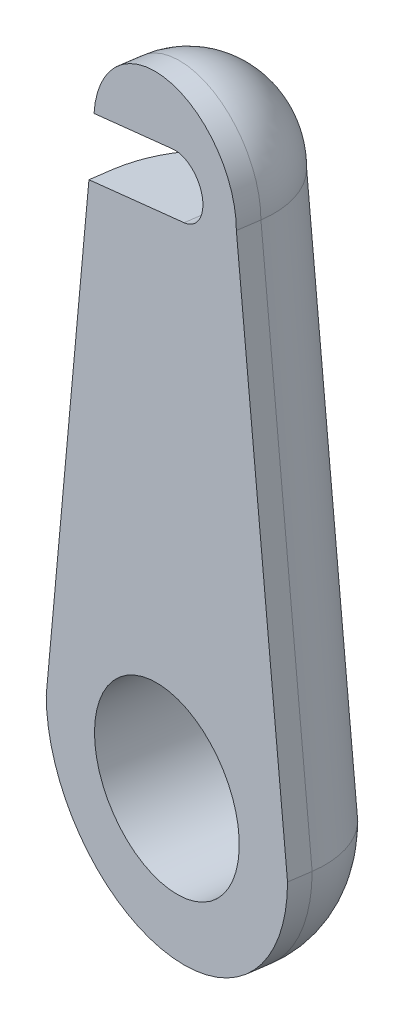
ISO-10303-21;
HEADER;
FILE_DESCRIPTION(('STEP AP214'),'2;1');
FILE_NAME('part.step','',(''),(''),'','','');
FILE_SCHEMA(('AUTOMOTIVE_DESIGN { 1 0 10303 214 1 1 1 1 }'));
ENDSEC;
DATA;
#1=APPLICATION_CONTEXT('core data for automotive mechanical design processes');
#2=APPLICATION_PROTOCOL_DEFINITION('international standard','automotive_design',2000,#1);
#3=PRODUCT_CONTEXT('',#1,'mechanical');
#4=PRODUCT('Part','Part','',(#3));
#5=PRODUCT_RELATED_PRODUCT_CATEGORY('part','',(#4));
#6=PRODUCT_DEFINITION_FORMATION('','',#4);
#7=PRODUCT_DEFINITION_CONTEXT('part definition',#1,'design');
#8=PRODUCT_DEFINITION('design','',#6,#7);
#9=PRODUCT_DEFINITION_SHAPE('','',#8);
#10=(LENGTH_UNIT() NAMED_UNIT(*) SI_UNIT(.MILLI.,.METRE.));
#11=(NAMED_UNIT(*) PLANE_ANGLE_UNIT() SI_UNIT($,.RADIAN.));
#12=(NAMED_UNIT(*) SI_UNIT($,.STERADIAN.) SOLID_ANGLE_UNIT());
#13=UNCERTAINTY_MEASURE_WITH_UNIT(LENGTH_MEASURE(1.E-05),#10,'distance_accuracy_value','');
#14=(GEOMETRIC_REPRESENTATION_CONTEXT(3) GLOBAL_UNCERTAINTY_ASSIGNED_CONTEXT((#13)) GLOBAL_UNIT_ASSIGNED_CONTEXT((#10,
#11,#12)) REPRESENTATION_CONTEXT('',''));
#15=CARTESIAN_POINT('',(0.,0.,0.));
#16=DIRECTION('',(0.,0.,1.));
#17=DIRECTION('',(1.,0.,0.));
#18=AXIS2_PLACEMENT_3D('',#15,#16,#17);
#19=CARTESIAN_POINT('',(1.32790792519997,202.201022667801,-63.0828326373123));
#20=DIRECTION('',(-0.144222021755399,0.,0.98954535441322));
#21=DIRECTION('',(0.98954535441322,0.,0.144222021755399));
#22=AXIS2_PLACEMENT_3D('',#19,#20,#21);
#23=CYLINDRICAL_SURFACE('',#22,8.89);
#24=DIRECTION('',(-0.144222021755399,0.,0.98954535441322));
#25=VECTOR('',#24,1.);
#26=CARTESIAN_POINT('',(-7.46915027553356,202.201022667801,-64.3649664107178));
#27=LINE('',#26,#25);
#28=CARTESIAN_POINT('',(-8.19026038431056,202.201022667801,-59.4172396386517));
#29=VERTEX_POINT('',#28);
#30=CARTESIAN_POINT('',(-8.38496011368034,202.201022667801,-58.0813534101938));
#31=VERTEX_POINT('',#30);
#32=EDGE_CURVE('E152',#29,#31,#27,.T.);
#33=ORIENTED_EDGE('',*,*,#32,.F.);
#34=CARTESIAN_POINT('',(0.606797816422972,202.201022667801,-58.1351058652462));
#35=DIRECTION('',(0.144222021755399,0.,-0.98954535441322));
#36=DIRECTION('',(-0.98954535441322,0.,-0.144222021755399));
#37=AXIS2_PLACEMENT_3D('',#34,#35,#36);
#38=CIRCLE('',#37,8.89);
#39=CARTESIAN_POINT('',(9.4038560171565,202.201022667801,-56.8529720918407));
#40=VERTEX_POINT('',#39);
#41=EDGE_CURVE('E150',#29,#40,#38,.F.);
#42=ORIENTED_EDGE('',*,*,#41,.T.);
#43=DIRECTION('',(-0.144222021755399,0.,0.98954535441322));
#44=VECTOR('',#43,1.);
#45=CARTESIAN_POINT('',(10.1249661259335,202.201022667801,-61.8006988639068));
#46=LINE('',#45,#44);
#47=CARTESIAN_POINT('',(9.20915628778671,202.201022667801,-55.5170858633828));
#48=VERTEX_POINT('',#47);
#49=EDGE_CURVE('E255',#40,#48,#46,.T.);
#50=ORIENTED_EDGE('',*,*,#49,.T.);
#51=CARTESIAN_POINT('',(0.412098087053183,202.201022667801,-56.7992196367883));
#52=DIRECTION('',(0.144222021755399,0.,-0.98954535441322));
#53=DIRECTION('',(-0.98954535441322,0.,-0.144222021755399));
#54=AXIS2_PLACEMENT_3D('',#51,#52,#53);
#55=CIRCLE('',#54,8.89);
#56=EDGE_CURVE('E240',#48,#31,#55,.T.);
#57=ORIENTED_EDGE('',*,*,#56,.T.);
#58=EDGE_LOOP('',(#33,#42,#50,#57));
#59=FACE_BOUND('',#58,.T.);
#60=ADVANCED_FACE('F39',(#59),#23,.T.);
#61=CARTESIAN_POINT('',(-3.99727184027272,235.201022667801,-63.85895491262));
#62=DIRECTION('',(0.983999449071481,-0.105724104961713,0.143413729667237));
#63=DIRECTION('',(0.144222021755399,0.,-0.98954535441322));
#64=AXIS2_PLACEMENT_3D('',#61,#62,#63);
#65=PLANE('',#64);
#66=DIRECTION('',(0.104618796914359,0.994395501613943,0.0152477441658583));
#67=VECTOR('',#66,1.);
#68=CARTESIAN_POINT('',(-4.9130816784195,235.201022667801,-57.5753419120961));
#69=LINE('',#68,#67);
#70=CARTESIAN_POINT('',(-5.27238963990794,231.785821660561,-57.6277095174894));
#71=VERTEX_POINT('',#70);
#72=EDGE_CURVE('E289',#31,#71,#69,.T.);
#73=ORIENTED_EDGE('',*,*,#72,.T.);
#74=DIRECTION('',(0.144222021755399,0.,-0.98954535441322));
#75=VECTOR('',#74,1.);
#76=CARTESIAN_POINT('',(-4.35657980176115,231.785821660561,-63.9113225180133));
#77=LINE('',#76,#75);
#78=CARTESIAN_POINT('',(-5.07768991053815,231.785821660561,-58.9635957459472));
#79=VERTEX_POINT('',#78);
#80=EDGE_CURVE('E172',#71,#79,#77,.T.);
#81=ORIENTED_EDGE('',*,*,#80,.T.);
#82=DIRECTION('',(0.104618796914359,0.994395501613943,0.0152477441658583));
#83=VECTOR('',#82,1.);
#84=CARTESIAN_POINT('',(-8.19026038431056,202.201022667801,-59.4172396386517));
#85=LINE('',#84,#83);
#86=EDGE_CURVE('E157',#79,#29,#85,.F.);
#87=ORIENTED_EDGE('',*,*,#86,.T.);
#88=ORIENTED_EDGE('',*,*,#32,.T.);
#89=EDGE_LOOP('',(#73,#81,#87,#88));
#90=FACE_BOUND('',#89,.T.);
#91=ADVANCED_FACE('F227',(#90),#65,.F.);
#92=CARTESIAN_POINT('',(1.19784127039669,235.201022667801,-63.1017892984042));
#93=DIRECTION('',(-0.144222021755399,0.,0.98954535441322));
#94=DIRECTION('',(0.98954535441322,0.,0.144222021755399));
#95=AXIS2_PLACEMENT_3D('',#92,#93,#94);
#96=CYLINDRICAL_SURFACE('',#95,5.25);
#97=CARTESIAN_POINT('',(0.476731161619694,235.201022667801,-58.1540625263381));
#98=DIRECTION('',(0.144222021755399,0.,-0.98954535441322));
#99=DIRECTION('',(-0.98954535441322,0.,-0.144222021755399));
#100=AXIS2_PLACEMENT_3D('',#97,#98,#99);
#101=CIRCLE('',#100,5.25);
#102=CARTESIAN_POINT('',(5.6718442722891,235.201022667801,-57.3968969121223));
#103=VERTEX_POINT('',#102);
#104=CARTESIAN_POINT('',(-4.70527140568887,235.573768649503,-58.909317334686));
#105=VERTEX_POINT('',#104);
#106=EDGE_CURVE('E147',#103,#105,#101,.F.);
#107=ORIENTED_EDGE('',*,*,#106,.T.);
#108=DIRECTION('',(-0.144222021755399,0.,0.98954535441322));
#109=VECTOR('',#108,1.);
#110=CARTESIAN_POINT('',(-3.98416129691187,235.573768649503,-63.8570441067521));
#111=LINE('',#110,#109);
#112=CARTESIAN_POINT('',(-4.89997113505866,235.573768649503,-57.5734311062281));
#113=VERTEX_POINT('',#112);
#114=EDGE_CURVE('E68',#105,#113,#111,.T.);
#115=ORIENTED_EDGE('',*,*,#114,.T.);
#116=CARTESIAN_POINT('',(0.282031432249903,235.201022667801,-56.8181762978803));
#117=DIRECTION('',(0.144222021755399,0.,-0.98954535441322));
#118=DIRECTION('',(-0.98954535441322,0.,-0.144222021755399));
#119=AXIS2_PLACEMENT_3D('',#116,#117,#118);
#120=CIRCLE('',#119,5.25);
#121=CARTESIAN_POINT('',(5.47714454291931,235.201022667801,-56.0610106836644));
#122=VERTEX_POINT('',#121);
#123=EDGE_CURVE('E258',#113,#122,#120,.T.);
#124=ORIENTED_EDGE('',*,*,#123,.T.);
#125=DIRECTION('',(-0.144222021755399,0.,0.98954535441322));
#126=VECTOR('',#125,1.);
#127=CARTESIAN_POINT('',(6.39295438106609,235.201022667801,-62.3446236841884));
#128=LINE('',#127,#126);
#129=EDGE_CURVE('E243',#103,#122,#128,.T.);
#130=ORIENTED_EDGE('',*,*,#129,.F.);
#131=EDGE_LOOP('',(#107,#115,#124,#130));
#132=FACE_BOUND('',#131,.T.);
#133=ADVANCED_FACE('F223',(#132),#96,.T.);
#134=CARTESIAN_POINT('',(10.1249661259335,202.201022667801,-61.8006988639068));
#135=DIRECTION('',(-0.983145599511407,-0.113546955234429,-0.143289284729692));
#136=DIRECTION('',(-0.144222021755399,0.,0.98954535441322));
#137=AXIS2_PLACEMENT_3D('',#134,#135,#136);
#138=PLANE('',#137);
#139=ORIENTED_EDGE('',*,*,#49,.F.);
#140=DIRECTION('',(0.112359862059995,-0.993532631047914,0.0163759714480791));
#141=VECTOR('',#140,1.);
#142=CARTESIAN_POINT('',(5.6718442722891,235.201022667801,-57.3968969121223));
#143=LINE('',#142,#141);
#144=EDGE_CURVE('E160',#40,#103,#143,.F.);
#145=ORIENTED_EDGE('',*,*,#144,.T.);
#146=ORIENTED_EDGE('',*,*,#129,.T.);
#147=DIRECTION('',(0.112359862059995,-0.993532631047914,0.016375971448079));
#148=VECTOR('',#147,1.);
#149=CARTESIAN_POINT('',(9.20915628778671,202.201022667801,-55.5170858633828));
#150=LINE('',#149,#148);
#151=EDGE_CURVE('E292',#122,#48,#150,.T.);
#152=ORIENTED_EDGE('',*,*,#151,.T.);
#153=EDGE_LOOP('',(#139,#145,#146,#152));
#154=FACE_BOUND('',#153,.T.);
#155=ADVANCED_FACE('F217',(#154),#138,.F.);
#156=CARTESIAN_POINT('',(1.32790792519997,202.201022667801,-63.0828326373123));
#157=DIRECTION('',(0.144222021755399,0.,-0.98954535441322));
#158=DIRECTION('',(-0.98954535441322,0.,-0.144222021755399));
#159=AXIS2_PLACEMENT_3D('',#156,#157,#158);
#160=PLANE('',#159);
#161=CARTESIAN_POINT('',(1.32790792519973,202.201022667801,-63.0828326373124));
#162=DIRECTION('',(0.144222021755399,0.,-0.98954535441322));
#163=DIRECTION('',(-0.98954535441322,0.,-0.144222021755399));
#164=AXIS2_PLACEMENT_3D('',#161,#162,#163);
#165=CIRCLE('',#164,5.334);
#166=CARTESIAN_POINT('',(-2.06352718910728,206.288247154302,-63.5771198639222));
#167=VERTEX_POINT('',#166);
#168=CARTESIAN_POINT('',(4.67897303171075,206.322112414766,-62.5944291674364));
#169=VERTEX_POINT('',#168);
#170=EDGE_CURVE('E60',#167,#169,#165,.T.);
#171=ORIENTED_EDGE('',*,*,#170,.F.);
#172=DIRECTION('',(0.104618796914359,0.994395501613943,0.0152477441658583));
#173=VECTOR('',#172,1.);
#174=CARTESIAN_POINT('',(0.922725405084686,234.672402142993,-63.1418862642839));
#175=LINE('',#174,#173);
#176=CARTESIAN_POINT('',(0.747199470832463,233.004038478097,-63.1674684217822));
#177=VERTEX_POINT('',#176);
#178=EDGE_CURVE('E137',#167,#177,#175,.T.);
#179=ORIENTED_EDGE('',*,*,#178,.T.);
#180=DIRECTION('',(-0.963046923912847,-0.229868866995661,-0.140359988344739));
#181=VECTOR('',#180,1.);
#182=CARTESIAN_POINT('',(-5.12264944920181,231.602969135389,-64.0229739070746));
#183=LINE('',#182,#181);
#184=CARTESIAN_POINT('',(1.63744916341812,233.216531434667,-63.0377183199206));
#185=VERTEX_POINT('',#184);
#186=EDGE_CURVE('E131',#185,#177,#183,.T.);
#187=ORIENTED_EDGE('',*,*,#186,.F.);
#188=DIRECTION('',(0.112359862059995,-0.993532631047914,0.0163759714480791));
#189=VECTOR('',#188,1.);
#190=CARTESIAN_POINT('',(5.20923812837646,201.633287891629,-62.5171452875552));
#191=LINE('',#190,#189);
#192=EDGE_CURVE('E140',#185,#169,#191,.T.);
#193=ORIENTED_EDGE('',*,*,#192,.T.);
#194=EDGE_LOOP('',(#171,#179,#187,#193));
#195=FACE_BOUND('',#194,.T.);
#196=ADVANCED_FACE('F135',(#195),#160,.T.);
#197=CARTESIAN_POINT('',(0.412098087053183,202.201022667801,-56.7992196367883));
#198=DIRECTION('',(0.144222021755399,0.,-0.98954535441322));
#199=DIRECTION('',(-0.98954535441322,0.,-0.144222021755399));
#200=AXIS2_PLACEMENT_3D('',#197,#198,#199);
#201=PLANE('',#200);
#202=CARTESIAN_POINT('',(0.412098087052936,202.201022667801,-56.7992196367884));
#203=DIRECTION('',(0.144222021755399,0.,-0.98954535441322));
#204=DIRECTION('',(-0.98954535441322,0.,-0.144222021755399));
#205=AXIS2_PLACEMENT_3D('',#202,#203,#204);
#206=CIRCLE('',#205,5.334);
#207=CARTESIAN_POINT('',(-4.86613683338719,202.201022667801,-57.5684999008317));
#208=VERTEX_POINT('',#207);
#209=EDGE_CURVE('E141',#208,#208,#206,.F.);
#210=ORIENTED_EDGE('',*,*,#209,.F.);
#211=EDGE_LOOP('',(#210));
#212=FACE_BOUND('',#211,.T.);
#213=CARTESIAN_POINT('',(1.25647789892657,235.193718971032,-56.6761548747189));
#214=DIRECTION('',(0.144222021755399,0.,-0.98954535441322));
#215=DIRECTION('',(-0.98954535441322,0.,-0.144222021755399));
#216=AXIS2_PLACEMENT_3D('',#213,#214,#215);
#217=CIRCLE('',#216,1.79999999999998);
#218=CARTESIAN_POINT('',(1.66591610395417,233.441920071354,-56.6164809997927));
#219=VERTEX_POINT('',#218);
#220=CARTESIAN_POINT('',(0.847039693898966,236.945517870711,-56.735828749645));
#221=VERTEX_POINT('',#220);
#222=EDGE_CURVE('E268',#219,#221,#217,.F.);
#223=ORIENTED_EDGE('',*,*,#222,.F.);
#224=DIRECTION('',(0.963046923912847,0.229868866995661,0.140359988344738));
#225=VECTOR('',#224,1.);
#226=CARTESIAN_POINT('',(-6.0384592873486,231.602969135389,-57.7393609065506));
#227=LINE('',#226,#225);
#228=EDGE_CURVE('E277',#71,#219,#227,.T.);
#229=ORIENTED_EDGE('',*,*,#228,.F.);
#230=ORIENTED_EDGE('',*,*,#72,.F.);
#231=ORIENTED_EDGE('',*,*,#56,.F.);
#232=ORIENTED_EDGE('',*,*,#151,.F.);
#233=ORIENTED_EDGE('',*,*,#123,.F.);
#234=DIRECTION('',(-0.963046923912849,-0.229868866995653,-0.140359988344738));
#235=VECTOR('',#234,1.);
#236=CARTESIAN_POINT('',(-6.85733569740383,235.106566934746,-57.8587086564029));
#237=LINE('',#236,#235);
#238=EDGE_CURVE('E275',#221,#113,#237,.T.);
#239=ORIENTED_EDGE('',*,*,#238,.F.);
#240=EDGE_LOOP('',(#223,#229,#230,#231,#232,#233,#239));
#241=FACE_BOUND('',#240,.T.);
#242=ADVANCED_FACE('F216',(#212,#241),#201,.F.);
#243=CARTESIAN_POINT('',(0.606797816422972,202.201022667801,-58.1351058652462));
#244=DIRECTION('',(0.144222021755399,0.,-0.98954535441322));
#245=DIRECTION('',(-0.98954535441322,0.,-0.144222021755399));
#246=AXIS2_PLACEMENT_3D('',#243,#244,#245);
#247=DEGENERATE_TOROIDAL_SURFACE('',#246,3.89,5.,.T.);
#248=CARTESIAN_POINT('',(1.29718102724183,202.201022667801,-62.8720072809629));
#249=DIRECTION('',(-0.144222021755399,0.,0.98954535441322));
#250=DIRECTION('',(0.98954535441322,0.,0.144222021755399));
#251=AXIS2_PLACEMENT_3D('',#248,#249,#250);
#252=CIRCLE('',#251,5.334);
#253=CARTESIAN_POINT('',(6.57251324391213,202.024148140251,-62.103150073634));
#254=VERTEX_POINT('',#253);
#255=CARTESIAN_POINT('',(-3.97853987187495,202.036412593816,-63.6409211371035));
#256=VERTEX_POINT('',#255);
#257=EDGE_CURVE('E127',#254,#256,#252,.F.);
#258=ORIENTED_EDGE('',*,*,#257,.F.);
#259=CARTESIAN_POINT('',(9.4038560171565,202.201022667801,-56.8529720918407));
#260=CARTESIAN_POINT('',(9.42412630268715,202.201024256078,-56.9919468087061));
#261=CARTESIAN_POINT('',(9.43851131748884,202.200685685068,-57.1317770213015));
#262=CARTESIAN_POINT('',(9.45547473273812,202.199339671023,-57.4121418751071));
#263=CARTESIAN_POINT('',(9.45805372614049,202.198332261583,-57.5526764805844));
#264=CARTESIAN_POINT('',(9.45137349914973,202.195660986856,-57.8333556116267));
#265=CARTESIAN_POINT('',(9.44212288736625,202.193997599544,-57.9735003465596));
#266=CARTESIAN_POINT('',(9.41186984101946,202.190036855361,-58.2525047068316));
#267=CARTESIAN_POINT('',(9.3908675444643,202.187739505934,-58.3913643472429));
#268=CARTESIAN_POINT('',(9.33725273725906,202.182540509831,-58.6668535079616));
#269=CARTESIAN_POINT('',(9.30463691425346,202.179638690849,-58.8034823803804));
#270=CARTESIAN_POINT('',(9.2280155962891,202.173268977993,-59.0735490941437));
#271=CARTESIAN_POINT('',(9.1840059112784,202.169800876044,-59.2069857417968));
#272=CARTESIAN_POINT('',(9.08494592308634,202.162348667695,-59.4695924130764));
#273=CARTESIAN_POINT('',(9.02990203638968,202.158364861656,-59.5987648657603));
#274=CARTESIAN_POINT('',(8.90912932363069,202.149933109739,-59.8520536001049));
#275=CARTESIAN_POINT('',(8.8433967871256,202.145485002876,-59.9761681071792));
#276=CARTESIAN_POINT('',(8.70170414407345,202.136186618706,-60.2184574512163));
#277=CARTESIAN_POINT('',(8.62574046156449,202.131336201014,-60.336630191507));
#278=CARTESIAN_POINT('',(8.46414443178475,202.121304196189,-60.5661540416459));
#279=CARTESIAN_POINT('',(8.3785120691605,202.116122608531,-60.6775051406611));
#280=CARTESIAN_POINT('',(8.19814501497439,202.105502140936,-60.8926513535883));
#281=CARTESIAN_POINT('',(8.10340599182041,202.10006313919,-60.9964428300897));
#282=CARTESIAN_POINT('',(7.90556838211683,202.0890149549,-61.1956453082782));
#283=CARTESIAN_POINT('',(7.80247268608047,202.083405831616,-61.2910591841292));
#284=CARTESIAN_POINT('',(7.58840658944286,202.072092874009,-61.4730624763079));
#285=CARTESIAN_POINT('',(7.47742054567895,202.066388869742,-61.5596334840118));
#286=CARTESIAN_POINT('',(7.24859307450871,202.054994522297,-61.7230903448754));
#287=CARTESIAN_POINT('',(7.13075414074614,202.049304174925,-61.7999796891798));
#288=CARTESIAN_POINT('',(6.88906966434531,202.038037749443,-61.9435428406534));
#289=CARTESIAN_POINT('',(6.76522667165525,202.032461624228,-62.0102209354013));
#290=CARTESIAN_POINT('',(6.51241076349984,202.021528780286,-62.1329170147282));
#291=CARTESIAN_POINT('',(6.38343931229342,202.016171999806,-62.1889380160328));
#292=CARTESIAN_POINT('',(6.08328599078852,202.004283379283,-62.3045790530669));
#293=CARTESIAN_POINT('',(5.91068506049706,201.997859821499,-62.3605532278855));
#294=CARTESIAN_POINT('',(5.56065983508997,201.985818914885,-62.4534609887416));
#295=CARTESIAN_POINT('',(5.38324407097413,201.980200238384,-62.4904261976493));
#296=CARTESIAN_POINT('',(5.19321504725838,201.974798125286,-62.5194416140154));
#297=CARTESIAN_POINT('',(5.1819540411644,201.974480279118,-62.5211219029397));
#298=CARTESIAN_POINT('',(5.17068795082224,201.974164594667,-62.5227638117806));
#299=B_SPLINE_CURVE_WITH_KNOTS('',3,(#259,#260,#261,#262,#263,#264,#265,#266,#267,#268,#269,
#270,#271,#272,#273,#274,#275,#276,#277,#278,#279,#280,#281,#282,#283,#284,#285,#286,#287,#288,
#289,#290,#291,#292,#293,#294,#295,#296,#297,#298),.UNSPECIFIED.,.F.,.F.,(4,2,2,2,2,2,2,2,2,2,2,
2,2,2,2,2,2,2,2,4),(0.,0.421206831369678,0.842392507488085,1.26327185380627,1.68414625755094,
2.1051407973978,2.52629037693698,2.94719576105399,3.36824757082313,3.78944692922255,
4.21064695647886,4.63204832876588,5.05330455829163,5.47542059181213,5.89738397447501,
6.3191696912057,6.7408358339336,7.2844667573262,7.82719035935125,7.86136039280626),.UNSPECIFIED.);
#300=EDGE_CURVE('E171',#40,#254,#299,.T.);
#301=ORIENTED_EDGE('',*,*,#300,.F.);
#302=ORIENTED_EDGE('',*,*,#41,.F.);
#303=CARTESIAN_POINT('',(-8.19026038431056,202.201022667801,-59.4172396386517));
#304=CARTESIAN_POINT('',(-8.17001660776571,202.20102414597,-59.5562425641094));
#305=CARTESIAN_POINT('',(-8.14388620286478,202.200708929707,-59.6943852891455));
#306=CARTESIAN_POINT('',(-8.0801048390943,202.19945576104,-59.9679752872192));
#307=CARTESIAN_POINT('',(-8.04245445524943,202.198517839716,-60.1034226944353));
#308=CARTESIAN_POINT('',(-7.95591503164534,202.196030810224,-60.3705645570106));
#309=CARTESIAN_POINT('',(-7.90703412949349,202.19448214402,-60.5022616525508));
#310=CARTESIAN_POINT('',(-7.79837201315606,202.190794553344,-60.7610688771204));
#311=CARTESIAN_POINT('',(-7.73859092761879,202.188655635838,-60.8881790602651));
#312=CARTESIAN_POINT('',(-7.6085337601283,202.183815156139,-61.1369471560684));
#313=CARTESIAN_POINT('',(-7.53825466917452,202.181113432544,-61.2586034924727));
#314=CARTESIAN_POINT('',(-7.38768721602802,202.175182921508,-61.4956053212382));
#315=CARTESIAN_POINT('',(-7.30739517718664,202.171953940329,-61.6109484729632));
#316=CARTESIAN_POINT('',(-7.13744357592207,202.165015530841,-61.8343920819168));
#317=CARTESIAN_POINT('',(-7.04778948519682,202.161306382869,-61.9424967097659));
#318=CARTESIAN_POINT('',(-6.85968004957816,202.153455922581,-62.1508077161011));
#319=CARTESIAN_POINT('',(-6.76122165415579,202.149314460392,-62.2510113342276));
#320=CARTESIAN_POINT('',(-6.55620211186518,202.140657399289,-62.4427961980552));
#321=CARTESIAN_POINT('',(-6.44963874469385,202.136141697824,-62.5343750655732));
#322=CARTESIAN_POINT('',(-6.22919035283221,202.126801991447,-62.7082325665623));
#323=CARTESIAN_POINT('',(-6.11530531794574,202.121977986107,-62.7905111870813));
#324=CARTESIAN_POINT('',(-5.88096608204634,202.112090453154,-62.945225410852));
#325=CARTESIAN_POINT('',(-5.76050875587446,202.107026811748,-63.0176562732658));
#326=CARTESIAN_POINT('',(-5.51397288404291,202.096741139091,-63.1520957167182));
#327=CARTESIAN_POINT('',(-5.38789629089693,202.091519163055,-63.214107882742));
#328=CARTESIAN_POINT('',(-5.1307385626108,202.080988129643,-63.3274109665633));
#329=CARTESIAN_POINT('',(-4.99964860459529,202.0756789291,-63.3786818475399));
#330=CARTESIAN_POINT('',(-4.73366438231908,202.06507336272,-63.469982569554));
#331=CARTESIAN_POINT('',(-4.5987715128207,202.059776992932,-63.5100164743501));
#332=CARTESIAN_POINT('',(-4.32614793975179,202.049290808276,-63.5785759745851));
#333=CARTESIAN_POINT('',(-4.18841847768371,202.044100948696,-63.6071064967909));
#334=CARTESIAN_POINT('',(-3.91108867952755,202.03392565402,-63.652482716766));
#335=CARTESIAN_POINT('',(-3.77148888769873,202.028940161098,-63.6693317416333));
#336=CARTESIAN_POINT('',(-3.45132075089665,202.017893493652,-63.6943769849195));
#337=CARTESIAN_POINT('',(-3.27043892312382,202.011931773933,-63.6987274665849));
#338=CARTESIAN_POINT('',(-2.9094860490671,202.000754457304,-63.6879029349285));
#339=CARTESIAN_POINT('',(-2.7294141545686,201.99553763564,-63.6727603922478));
#340=CARTESIAN_POINT('',(-2.53910521984101,201.990508218119,-63.6463914536853));
#341=CARTESIAN_POINT('',(-2.52742428990585,201.990201479088,-63.6447309723335));
#342=CARTESIAN_POINT('',(-2.51574990281989,201.989896900747,-63.6430293988055));
#343=B_SPLINE_CURVE_WITH_KNOTS('',3,(#303,#304,#305,#306,#307,#308,#309,#310,#311,#312,#313,
#314,#315,#316,#317,#318,#319,#320,#321,#322,#323,#324,#325,#326,#327,#328,#329,#330,#331,#332,
#333,#334,#335,#336,#337,#338,#339,#340,#341,#342),.UNSPECIFIED.,.F.,.F.,(4,2,2,2,2,2,2,2,2,2,2,
2,2,2,2,2,2,2,2,4),(0.,0.421279105882247,0.842537186867095,1.26349098257098,1.68443981033215,
2.10550952528328,2.52673431036025,2.94771427197359,3.36884066476029,3.7900828407431,
4.21132560335999,4.6327704450172,5.0540699727599,5.47614853048732,5.89807424978274,
6.31981907068573,6.74144372177308,7.2834881738521,7.82463087889462,7.86003758452581),.UNSPECIFIED.);
#344=EDGE_CURVE('E197',#256,#29,#343,.F.);
#345=ORIENTED_EDGE('',*,*,#344,.F.);
#346=EDGE_LOOP('',(#258,#301,#302,#345));
#347=FACE_BOUND('',#346,.T.);
#348=ADVANCED_FACE('F41',(#347),#247,.T.);
#349=CARTESIAN_POINT('',(-3.17193326111293,202.607021839285,-58.6858398293254));
#350=DIRECTION('',(-0.104618796914359,-0.994395501613943,-0.0152477441658583));
#351=DIRECTION('',(0.994511117120026,-0.104630960641097,0.));
#352=AXIS2_PLACEMENT_3D('',#349,#350,#351);
#353=CYLINDRICAL_SURFACE('',#352,5.);
#354=CARTESIAN_POINT('',(-3.94766854956164,201.629570040267,-63.6574915342594));
#355=CARTESIAN_POINT('',(-3.96432188749141,201.773665005614,-63.6510133255928));
#356=CARTESIAN_POINT('',(-3.97493342858699,201.918493385998,-63.6450965918439));
#357=CARTESIAN_POINT('',(-3.98398351654456,202.208580424699,-63.6347961659688));
#358=CARTESIAN_POINT('',(-3.98242227019912,202.353839075665,-63.6304124478009));
#359=CARTESIAN_POINT('',(-3.96707006707929,202.643149912608,-63.6236021421536));
#360=CARTESIAN_POINT('',(-3.95333019294466,202.78720460363,-63.6211674606315));
#361=CARTESIAN_POINT('',(-3.91379189958018,203.073659960349,-63.6182603342992));
#362=CARTESIAN_POINT('',(-3.88799411292683,203.216060712412,-63.6177877865653));
#363=CARTESIAN_POINT('',(-3.82455940452392,203.498288878837,-63.6185603652297));
#364=CARTESIAN_POINT('',(-3.78691481597625,203.638114564509,-63.6198066057339));
#365=CARTESIAN_POINT('',(-3.70014267150966,203.914206428317,-63.623489823045));
#366=CARTESIAN_POINT('',(-3.65100974297863,204.050470907778,-63.6259273575532));
#367=CARTESIAN_POINT('',(-3.54170547848049,204.318578359655,-63.631224635489));
#368=CARTESIAN_POINT('',(-3.48152764533985,204.450418675275,-63.6340846272332));
#369=CARTESIAN_POINT('',(-3.35068605936689,204.708801318391,-63.639257596278));
#370=CARTESIAN_POINT('',(-3.28002198647397,204.835343484027,-63.6415705568766));
#371=CARTESIAN_POINT('',(-3.12780131015476,205.084005146356,-63.644547613267));
#372=CARTESIAN_POINT('',(-3.04611428313563,205.206045111585,-63.645189738828));
#373=CARTESIAN_POINT('',(-2.87325332647058,205.44316541499,-63.6434729862167));
#374=CARTESIAN_POINT('',(-2.78208077487341,205.558246760279,-63.6411145434069));
#375=CARTESIAN_POINT('',(-2.59089998096309,205.780802387175,-63.6320147433315));
#376=CARTESIAN_POINT('',(-2.49088549018956,205.88827119094,-63.6252702647813));
#377=CARTESIAN_POINT('',(-2.2829207598651,206.094792728882,-63.6059415588295));
#378=CARTESIAN_POINT('',(-2.17496545260516,206.193840000111,-63.5933535744976));
#379=CARTESIAN_POINT('',(-2.06352718910727,206.288247154302,-63.5771198639222));
#380=B_SPLINE_CURVE_WITH_KNOTS('',3,(#354,#355,#356,#357,#358,#359,#360,#361,#362,#363,#364,
#365,#366,#367,#368,#369,#370,#371,#372,#373,#374,#375,#376,#377,#378,#379),.UNSPECIFIED.,.F.,
.F.,(4,2,2,2,2,2,2,2,2,2,2,2,4),(0.,0.435484494508397,0.870961590977159,1.3046206991464,
1.73825705945014,2.17217463177012,2.60629553634203,3.04067263614974,3.47506299672608,
3.91513705434337,4.35514726742529,4.7954709531655,5.23607812650246),.UNSPECIFIED.);
#381=EDGE_CURVE('E123',#256,#167,#380,.T.);
#382=ORIENTED_EDGE('',*,*,#381,.F.);
#383=ORIENTED_EDGE('',*,*,#344,.T.);
#384=ORIENTED_EDGE('',*,*,#86,.F.);
#385=CARTESIAN_POINT('',(0.0260893620554628,233.004038478097,-58.2197416497161));
#386=DIRECTION('',(0.227465669459786,-0.973221610932542,0.0331521527367372));
#387=DIRECTION('',(-0.963046923912847,-0.229868866995661,-0.140359988344738));
#388=AXIS2_PLACEMENT_3D('',#385,#386,#387);
#389=ELLIPSE('',#388,5.29961640068069,5.);
#390=EDGE_CURVE('E146',#177,#79,#389,.F.);
#391=ORIENTED_EDGE('',*,*,#390,.F.);
#392=ORIENTED_EDGE('',*,*,#178,.F.);
#393=EDGE_LOOP('',(#382,#383,#384,#391,#392));
#394=FACE_BOUND('',#393,.T.);
#395=ADVANCED_FACE('F144',(#394),#353,.T.);
#396=CARTESIAN_POINT('',(4.37470833077723,202.636191951693,-57.5859489521749));
#397=DIRECTION('',(-0.112359862059995,0.993532631047914,-0.0163759714480791));
#398=DIRECTION('',(-0.993665876883534,-0.1123749310001,0.));
#399=AXIS2_PLACEMENT_3D('',#396,#397,#398);
#400=CYLINDRICAL_SURFACE('',#399,5.);
#401=CARTESIAN_POINT('',(4.67897303171075,206.322112414766,-62.5944291674364));
#402=CARTESIAN_POINT('',(4.79218767989111,206.228119510901,-62.5779205545603));
#403=CARTESIAN_POINT('',(4.90100001833709,206.129376180648,-62.5588537490693));
#404=CARTESIAN_POINT('',(5.10927222595604,205.923256195356,-62.5173083063318));
#405=CARTESIAN_POINT('',(5.20873831432648,205.81588537077,-62.494831964277));
#406=CARTESIAN_POINT('',(5.39786063777494,205.593323419882,-62.4481607816949));
#407=CARTESIAN_POINT('',(5.48752331773881,205.478137513029,-62.4239670876438));
#408=CARTESIAN_POINT('',(5.65681072126098,205.240621273164,-62.3754113544114));
#409=CARTESIAN_POINT('',(5.73643383404349,205.118289798293,-62.3510492888759));
#410=CARTESIAN_POINT('',(5.88527134677767,204.867379653281,-62.3036436305471));
#411=CARTESIAN_POINT('',(5.95449611059293,204.738807374694,-62.2805987393353));
#412=CARTESIAN_POINT('',(6.08237120941572,204.476087054722,-62.2371178969221));
#413=CARTESIAN_POINT('',(6.14102197948061,204.341939243017,-62.2166818383928));
#414=CARTESIAN_POINT('',(6.24745250535609,204.069015122609,-62.1795742932206));
#415=CARTESIAN_POINT('',(6.29524097919494,203.930242628967,-62.1628997876545));
#416=CARTESIAN_POINT('',(6.37975673910368,203.648901638971,-62.1342083916659));
#417=CARTESIAN_POINT('',(6.41648454875167,203.506333322648,-62.1221912807688));
#418=CARTESIAN_POINT('',(6.47883528930088,203.217595604972,-62.1033909623392));
#419=CARTESIAN_POINT('',(6.5043942357299,203.071410396631,-62.0966377423554));
#420=CARTESIAN_POINT('',(6.54392766528875,202.777325771834,-62.0887776913645));
#421=CARTESIAN_POINT('',(6.55790131470499,202.629426232786,-62.0876712666887));
#422=CARTESIAN_POINT('',(6.57418442131678,202.332357434524,-62.0910486912988));
#423=CARTESIAN_POINT('',(6.57644057382431,202.18318545961,-62.0955579723184));
#424=CARTESIAN_POINT('',(6.57093914192347,201.959876182379,-62.1062124221834));
#425=CARTESIAN_POINT('',(6.56762350492767,201.885506101872,-62.1104130261832));
#426=CARTESIAN_POINT('',(6.5580305741322,201.737035913282,-62.1200192023105));
#427=CARTESIAN_POINT('',(6.55175331361839,201.662935802176,-62.1254247608952));
#428=CARTESIAN_POINT('',(6.5439959237655,201.589027184392,-62.1313867477719));
#429=B_SPLINE_CURVE_WITH_KNOTS('',3,(#401,#402,#403,#404,#405,#406,#407,#408,#409,#410,#411,
#412,#413,#414,#415,#416,#417,#418,#419,#420,#421,#422,#423,#424,#425,#426,#427,#428),
.UNSPECIFIED.,.F.,.F.,(4,2,2,2,2,2,2,2,2,2,2,2,2,4),(0.,0.443955942251271,0.887614342935125,
1.33097930060377,1.77441530269455,2.21740636427612,2.6603791952317,3.10299523291914,
3.54559031521868,3.99068872848229,4.43581916961625,4.88297281469066,5.10660052770249,
5.33022572740823),.UNSPECIFIED.);
#430=EDGE_CURVE('E11',#169,#254,#429,.T.);
#431=ORIENTED_EDGE('',*,*,#430,.F.);
#432=ORIENTED_EDGE('',*,*,#192,.F.);
#433=CARTESIAN_POINT('',(0.916339054641117,233.216531434667,-58.0899915478545));
#434=DIRECTION('',(0.227465669459786,-0.973221610932542,0.0331521527367372));
#435=DIRECTION('',(0.963046923912847,0.229868866995661,0.140359988344738));
#436=AXIS2_PLACEMENT_3D('',#433,#434,#435);
#437=ELLIPSE('',#436,5.03510303826492,5.);
#438=CARTESIAN_POINT('',(2.56792096501173,233.441920071354,-62.8053744090909));
#439=VERTEX_POINT('',#438);
#440=EDGE_CURVE('E54',#439,#185,#437,.F.);
#441=ORIENTED_EDGE('',*,*,#440,.F.);
#442=CARTESIAN_POINT('',(3.80863593808747,235.591020423017,-62.0142465896172));
#443=CARTESIAN_POINT('',(3.81807412307109,235.547033081056,-62.0099257333251));
#444=CARTESIAN_POINT('',(3.82602000716015,235.50260565281,-62.0068377403413));
#445=CARTESIAN_POINT('',(3.83888010627895,235.413223804265,-62.0031449088271));
#446=CARTESIAN_POINT('',(3.84379510358993,235.368269523005,-62.0025394293241));
#447=CARTESIAN_POINT('',(3.85053461970724,235.278386309637,-62.0038236287937));
#448=CARTESIAN_POINT('',(3.85237426319311,235.233458346278,-62.0057010147404));
#449=CARTESIAN_POINT('',(3.85301590192034,235.143757663507,-62.0118580477021));
#450=CARTESIAN_POINT('',(3.85181787348206,235.098984945308,-62.0161377134434));
#451=CARTESIAN_POINT('',(3.8437064855373,234.965434326736,-62.0324122494039));
#452=CARTESIAN_POINT('',(3.83228551412409,234.877291526846,-62.0478450838213));
#453=CARTESIAN_POINT('',(3.79797938113615,234.705029390291,-62.0864095193178));
#454=CARTESIAN_POINT('',(3.77508283790902,234.620914139131,-62.1095487560686));
#455=CARTESIAN_POINT('',(3.7170848893939,234.453987622487,-62.1630926162074));
#456=CARTESIAN_POINT('',(3.68139979901325,234.371482945005,-62.1938178697814));
#457=CARTESIAN_POINT('',(3.59902854263614,234.214058824391,-62.2596701699891));
#458=CARTESIAN_POINT('',(3.55233532933385,234.13914428451,-62.2948000296405));
#459=CARTESIAN_POINT('',(3.44205642634494,233.988943343118,-62.3721683441175));
#460=CARTESIAN_POINT('',(3.3770696236199,233.914851744044,-62.4147396107414));
#461=CARTESIAN_POINT('',(3.23527867096431,233.77944205339,-62.5003486635279));
#462=CARTESIAN_POINT('',(3.15848153974741,233.718116425787,-62.5433861585883));
#463=CARTESIAN_POINT('',(2.99982804805911,233.613482731277,-62.6248327289524));
#464=CARTESIAN_POINT('',(2.91864978984064,233.569246373921,-62.663359124072));
#465=CARTESIAN_POINT('',(2.79117681563516,233.513389493383,-62.718686511478));
#466=CARTESIAN_POINT('',(2.74767032482604,233.496503981694,-62.7367420213935));
#467=CARTESIAN_POINT('',(2.65898769723123,233.466411404416,-62.7718527707778));
#468=CARTESIAN_POINT('',(2.61381077886713,233.453206086069,-62.7889075320985));
#469=CARTESIAN_POINT('',(2.56792096501173,233.441920071354,-62.8053744090909));
#470=B_SPLINE_CURVE_WITH_KNOTS('',3,(#442,#443,#444,#445,#446,#447,#448,#449,#450,#451,#452,
#453,#454,#455,#456,#457,#458,#459,#460,#461,#462,#463,#464,#465,#466,#467,#468,#469),
.UNSPECIFIED.,.F.,.F.,(4,2,2,2,2,2,2,2,2,2,2,2,2,4),(0.,0.135541426394774,0.271047854469624,
0.405885875972972,0.540724948586424,0.810009840943074,1.07956234438925,1.36343267094288,
1.64748522471402,1.96812236587784,2.28856968800559,2.58766433584612,2.73762983890284,
2.88766642018315),.UNSPECIFIED.);
#471=CARTESIAN_POINT('',(3.8506196240398,235.082603566778,-62.0182917913798));
#472=VERTEX_POINT('',#471);
#473=EDGE_CURVE('E279',#472,#439,#470,.T.);
#474=ORIENTED_EDGE('',*,*,#473,.F.);
#475=CARTESIAN_POINT('',(5.6718442722891,235.201022667801,-57.3968969121223));
#476=CARTESIAN_POINT('',(5.6921128946998,235.201024769208,-57.535860640553));
#477=CARTESIAN_POINT('',(5.70649729355467,235.20068576026,-57.6756797303885));
#478=CARTESIAN_POINT('',(5.72346116768413,235.199340612671,-57.9560224087309));
#479=CARTESIAN_POINT('',(5.7260412283821,235.198334507118,-58.0965459619547));
#480=CARTESIAN_POINT('',(5.71936442135652,235.195671233455,-58.3772021687543));
#481=CARTESIAN_POINT('',(5.71011625044319,235.194014544313,-58.5173350336969));
#482=CARTESIAN_POINT('',(5.67986869396257,235.19008001774,-58.7963160734491));
#483=CARTESIAN_POINT('',(5.65886944849671,235.187802187715,-58.9351642635551));
#484=CARTESIAN_POINT('',(5.60526081339178,235.182665741769,-59.2106281041052));
#485=CARTESIAN_POINT('',(5.57264836062561,235.179806972703,-59.3472431555785));
#486=CARTESIAN_POINT('',(5.49603236471011,235.173561500737,-59.6172828780554));
#487=CARTESIAN_POINT('',(5.45202463138973,235.170174603821,-59.7507063557261));
#488=CARTESIAN_POINT('',(5.35296226459328,235.162942041596,-60.013295727302));
#489=CARTESIAN_POINT('',(5.2979133321719,235.159096613462,-60.1424637785608));
#490=CARTESIAN_POINT('',(5.17712428125916,235.15102440469,-60.3957431880143));
#491=CARTESIAN_POINT('',(5.111380449902,235.146797491843,-60.5198527713203));
#492=CARTESIAN_POINT('',(4.96965890417239,235.138057485783,-60.7621280978926));
#493=CARTESIAN_POINT('',(4.89367786556122,235.133544299864,-60.8802918932449));
#494=CARTESIAN_POINT('',(4.73203768294453,235.124345911351,-61.1097963284025));
#495=CARTESIAN_POINT('',(4.6463785296831,235.119660708593,-61.2211369616822));
#496=CARTESIAN_POINT('',(4.46597547171493,235.110251407028,-61.4362258112939));
#497=CARTESIAN_POINT('',(4.37123012904367,235.105527302174,-61.5399728212762));
#498=CARTESIAN_POINT('',(4.17337216637029,235.096203157657,-61.73908942523));
#499=CARTESIAN_POINT('',(4.07026245929619,235.091603075541,-61.8344619117764));
#500=CARTESIAN_POINT('',(3.85626593287828,235.082717865121,-62.0162954410974));
#501=CARTESIAN_POINT('',(3.74537112247076,235.078433069962,-62.1027470954805));
#502=CARTESIAN_POINT('',(3.51672806579022,235.070436499507,-62.2659903512105));
#503=CARTESIAN_POINT('',(3.39898240471624,235.066724509966,-62.3427855623198));
#504=CARTESIAN_POINT('',(3.15730360840875,235.060210148535,-62.4863006606108));
#505=CARTESIAN_POINT('',(3.03336366645663,235.057408803861,-62.5530091248012));
#506=CARTESIAN_POINT('',(2.7803446834546,235.053212091613,-62.6757657552946));
#507=CARTESIAN_POINT('',(2.65126810414267,235.05181605878,-62.7318189554758));
#508=CARTESIAN_POINT('',(2.43306647980085,235.051380377605,-62.8159003664478));
#509=CARTESIAN_POINT('',(2.34511552979777,235.051705816758,-62.8470115106811));
#510=CARTESIAN_POINT('',(2.16757644789658,235.053773884446,-62.9043278194207));
#511=CARTESIAN_POINT('',(2.07798745777023,235.055517277981,-62.9305303262777));
#512=CARTESIAN_POINT('',(1.89796853205215,235.061282208587,-62.9778356192496));
#513=CARTESIAN_POINT('',(1.80754366594695,235.065294208426,-62.9989592305939));
#514=CARTESIAN_POINT('',(1.6259221518104,235.077003665386,-63.0361876866358));
#515=CARTESIAN_POINT('',(1.5347269909726,235.084695142941,-63.0523006044193));
#516=CARTESIAN_POINT('',(1.43738955212422,235.098628136029,-63.0668637979622));
#517=CARTESIAN_POINT('',(1.43088388038855,235.099586890436,-63.0678244755294));
#518=CARTESIAN_POINT('',(1.42438038636872,235.10057417711,-63.0687721868929));
#519=B_SPLINE_CURVE_WITH_KNOTS('',3,(#475,#476,#477,#478,#479,#480,#481,#482,#483,#484,#485,
#486,#487,#488,#489,#490,#491,#492,#493,#494,#495,#496,#497,#498,#499,#500,#501,#502,#503,#504,
#505,#506,#507,#508,#509,#510,#511,#512,#513,#514,#515,#516,#517,#518),.UNSPECIFIED.,.F.,.F.,(4,
2,2,2,2,2,2,2,2,2,2,2,2,2,2,2,2,2,2,2,2,4),(0.,0.421173551440359,0.842326215007328,
1.26316940035429,1.68400756833183,2.10495681990161,2.52606107953528,2.94694846177542,
3.36798227330324,3.789153134451,4.21032439839949,4.63156242651963,5.05265438121963,
5.47418507283806,5.89555771682023,6.31740403734576,6.73905056653396,7.01879367561799,
7.29868780907056,7.57741392232021,7.85568860507643,7.87562571439147),.UNSPECIFIED.);
#520=EDGE_CURVE('E163',#103,#472,#519,.T.);
#521=ORIENTED_EDGE('',*,*,#520,.F.);
#522=ORIENTED_EDGE('',*,*,#144,.F.);
#523=ORIENTED_EDGE('',*,*,#300,.T.);
#524=EDGE_LOOP('',(#431,#432,#441,#474,#521,#522,#523));
#525=FACE_BOUND('',#524,.T.);
#526=ADVANCED_FACE('F178',(#525),#400,.T.);
#527=CARTESIAN_POINT('',(0.476731161619692,235.201022667801,-58.1540625263381));
#528=DIRECTION('',(0.144222021755399,0.,-0.98954535441322));
#529=DIRECTION('',(-0.98954535441322,0.,-0.144222021755399));
#530=AXIS2_PLACEMENT_3D('',#527,#528,#529);
#531=DEGENERATE_TOROIDAL_SURFACE('',#530,0.250000000000001,5.,.T.);
#532=CARTESIAN_POINT('',(0.94061888241565,236.510313883236,-63.019641750169));
#533=CARTESIAN_POINT('',(0.976485635029567,236.544925381545,-63.0083096943122));
#534=CARTESIAN_POINT('',(1.01371647454441,236.577924892825,-62.9964862284559));
#535=CARTESIAN_POINT('',(1.09065366666024,236.640513115453,-62.9719285817634));
#536=CARTESIAN_POINT('',(1.13035970075542,236.670102264252,-62.9591945180713));
#537=CARTESIAN_POINT('',(1.25265760143323,236.753372026685,-62.9197842871469));
#538=CARTESIAN_POINT('',(1.33857934771923,236.801699269047,-62.891852724696));
#539=CARTESIAN_POINT('',(1.51698306787346,236.882822730758,-62.8333531149527));
#540=CARTESIAN_POINT('',(1.60948790189868,236.915561457323,-62.8027757919998));
#541=CARTESIAN_POINT('',(1.79822442743103,236.964492202444,-62.7399014625324));
#542=CARTESIAN_POINT('',(1.8944562443776,236.980683663562,-62.7076043981226));
#543=CARTESIAN_POINT('',(2.08939768663223,236.996257795223,-62.641711060397));
#544=CARTESIAN_POINT('',(2.18812300074781,236.995392967894,-62.6081027313406));
#545=CARTESIAN_POINT('',(2.38393728628409,236.976310023149,-62.5409978758068));
#546=CARTESIAN_POINT('',(2.48102597577144,236.958088946327,-62.5075013693738));
#547=CARTESIAN_POINT('',(2.67154146078561,236.904585963181,-62.4413666628487));
#548=CARTESIAN_POINT('',(2.76493661118733,236.869181346218,-62.408736444327));
#549=CARTESIAN_POINT('',(2.94464081460155,236.782197282209,-62.3455946679395));
#550=CARTESIAN_POINT('',(3.03095032611326,236.730618882782,-62.3150829730074));
#551=CARTESIAN_POINT('',(3.19358948136801,236.612934407461,-62.2572916592286));
#552=CARTESIAN_POINT('',(3.26996360240493,236.546896897724,-62.2299976911632));
#553=CARTESIAN_POINT('',(3.41090914702838,236.401943249491,-62.1793969854372));
#554=CARTESIAN_POINT('',(3.47548124085149,236.323027842812,-62.1560900213596));
#555=CARTESIAN_POINT('',(3.58988959184616,236.155879378065,-62.1146256743895));
#556=CARTESIAN_POINT('',(3.63994377106563,236.067814371569,-62.0963923239111));
#557=CARTESIAN_POINT('',(3.72509228602615,235.883843413995,-62.0652545600213));
#558=CARTESIAN_POINT('',(3.76018705397734,235.787937689546,-62.0523499926499));
#559=CARTESIAN_POINT('',(3.81374686598641,235.593020685045,-62.0325546398496));
#560=CARTESIAN_POINT('',(3.8325193794905,235.494104882707,-62.0255527439393));
#561=CARTESIAN_POINT('',(3.85394879402764,235.294337912669,-62.0174187991124));
#562=CARTESIAN_POINT('',(3.85661924939355,235.193488444453,-62.0162818133693));
#563=CARTESIAN_POINT('',(3.84827410917614,235.038459629365,-62.019076284219));
#564=CARTESIAN_POINT('',(3.84292024037591,234.983873487667,-62.0209414908795));
#565=CARTESIAN_POINT('',(3.82748196622788,234.875559215303,-62.0263951927922));
#566=CARTESIAN_POINT('',(3.81740586352576,234.82182974919,-62.0299806637325));
#567=CARTESIAN_POINT('',(3.80500002643915,234.768688030735,-62.0344131054732));
#568=B_SPLINE_CURVE_WITH_KNOTS('',3,(#532,#533,#534,#535,#536,#537,#538,#539,#540,#541,#542,
#543,#544,#545,#546,#547,#548,#549,#550,#551,#552,#553,#554,#555,#556,#557,#558,#559,#560,#561,
#562,#563,#564,#565,#566,#567),.UNSPECIFIED.,.F.,.F.,(4,2,2,2,2,2,2,2,2,2,2,2,2,2,2,2,2,4),(0.,
0.153250887877849,0.306482096114619,0.612312068913275,0.91926141537049,1.2262211018458,
1.5376382085893,1.84910842443538,2.16283637969316,2.47654401813981,2.78879506482938,
3.10102837328327,3.40829848391674,3.71555971624213,4.01689908920943,4.31798476634623,
4.48241275072711,4.6465527157232),.UNSPECIFIED.);
#569=CARTESIAN_POINT('',(1.7256316862007,236.945517870711,-62.7640802872732));
#570=VERTEX_POINT('',#569);
#571=EDGE_CURVE('E196',#570,#472,#568,.T.);
#572=ORIENTED_EDGE('',*,*,#571,.F.);
#573=CARTESIAN_POINT('',(-4.6337093036926,235.651649713867,-57.1140307976349));
#574=CARTESIAN_POINT('',(-4.66838414117964,235.638389171086,-57.2653968861122));
#575=CARTESIAN_POINT('',(-4.69577745251292,235.626768925494,-57.4185705359028));
#576=CARTESIAN_POINT('',(-4.73584655187824,235.60689536914,-57.7270581958056));
#577=CARTESIAN_POINT('',(-4.74852129486976,235.598642297478,-57.8823723571051));
#578=CARTESIAN_POINT('',(-4.75898134685506,235.585606879479,-58.193273668959));
#579=CARTESIAN_POINT('',(-4.75680204758653,235.580816313391,-58.3488592882157));
#580=CARTESIAN_POINT('',(-4.73766314619301,235.574719186897,-58.6591648773607));
#581=CARTESIAN_POINT('',(-4.72070639484289,235.573411954706,-58.81388500842));
#582=CARTESIAN_POINT('',(-4.67549671981866,235.574231715232,-59.1000154570516));
#583=CARTESIAN_POINT('',(-4.64910197962538,235.575914232343,-59.2317244072931));
#584=CARTESIAN_POINT('',(-4.58559834226548,235.581872649874,-59.4925230572504));
#585=CARTESIAN_POINT('',(-4.54848612153085,235.586149355225,-59.6216119311506));
#586=CARTESIAN_POINT('',(-4.46385220621197,235.597261540876,-59.8760958873894));
#587=CARTESIAN_POINT('',(-4.41633923746874,235.604094879645,-60.0014939667153));
#588=CARTESIAN_POINT('',(-4.31120672278575,235.620274409712,-60.2478661882419));
#589=CARTESIAN_POINT('',(-4.25358349266082,235.629621517693,-60.3688386982756));
#590=CARTESIAN_POINT('',(-4.12867890637513,235.650756161146,-60.6054089642418));
#591=CARTESIAN_POINT('',(-4.06140117796035,235.662542780687,-60.7210087175218));
#592=CARTESIAN_POINT('',(-3.9176285715683,235.688478217506,-60.946104343169));
#593=CARTESIAN_POINT('',(-3.84113049824029,235.702627854357,-61.0555980801307));
#594=CARTESIAN_POINT('',(-3.67947281687024,235.733186700989,-61.2676821286191));
#595=CARTESIAN_POINT('',(-3.59431195662031,235.749596237561,-61.3702714385379));
#596=CARTESIAN_POINT('',(-3.41594861623089,235.784555068191,-61.5678105612143));
#597=CARTESIAN_POINT('',(-3.32274610239828,235.803104371215,-61.6627603419603));
#598=CARTESIAN_POINT('',(-3.12877008739214,235.842248911463,-61.8445455684285));
#599=CARTESIAN_POINT('',(-3.02798151157122,235.862848250049,-61.9313640448303));
#600=CARTESIAN_POINT('',(-2.81976210081303,235.90590460101,-62.0960410256146));
#601=CARTESIAN_POINT('',(-2.71233352703384,235.928360981867,-62.173902554598));
#602=CARTESIAN_POINT('',(-2.49158103564657,235.974973685831,-62.3201712580296));
#603=CARTESIAN_POINT('',(-2.37825744434226,235.999129914873,-62.388578955006));
#604=CARTESIAN_POINT('',(-2.14656247934753,236.048959908807,-62.5154794126359));
#605=CARTESIAN_POINT('',(-2.02819287974199,236.074633141554,-62.573975622587));
#606=CARTESIAN_POINT('',(-1.78639240832041,236.127498925649,-62.6810933284897));
#607=CARTESIAN_POINT('',(-1.66293257521843,236.154700627353,-62.7296449157225));
#608=CARTESIAN_POINT('',(-1.41264248831279,236.21025444347,-62.8161016772255));
#609=CARTESIAN_POINT('',(-1.28581335739137,236.238606176233,-62.8540103509104));
#610=CARTESIAN_POINT('',(-1.02954646059471,236.296284836987,-62.9190981936616));
#611=CARTESIAN_POINT('',(-0.900106806153619,236.325612481751,-62.9462692789717));
#612=CARTESIAN_POINT('',(-0.639611040558965,236.385011765554,-62.9898615323306));
#613=CARTESIAN_POINT('',(-0.508554986385604,236.415083378405,-63.0062830782174));
#614=CARTESIAN_POINT('',(-0.241671013318977,236.476689720637,-63.0289156347332));
#615=CARTESIAN_POINT('',(-0.105819443024723,236.508241103768,-63.0348000328886));
#616=CARTESIAN_POINT('',(0.165854889567584,236.571704704857,-63.0357784263795));
#617=CARTESIAN_POINT('',(0.301677639892079,236.603616996927,-63.030870163925));
#618=CARTESIAN_POINT('',(0.572388984128709,236.66757383771,-63.0107615913505));
#619=CARTESIAN_POINT('',(0.707278292277656,236.699618246038,-62.9955703029453));
#620=CARTESIAN_POINT('',(0.975504428580339,236.763684988105,-62.9551837774792));
#621=CARTESIAN_POINT('',(1.10884191362828,236.795707325353,-62.9299929445208));
#622=CARTESIAN_POINT('',(1.32301672769097,236.847434175432,-62.880998512308));
#623=CARTESIAN_POINT('',(1.40456063958143,236.867198009518,-62.8603015173058));
#624=CARTESIAN_POINT('',(1.56642866706778,236.906573675972,-62.8150003776414));
#625=CARTESIAN_POINT('',(1.64675467851653,236.926185714783,-62.7904031805094));
#626=CARTESIAN_POINT('',(1.72644771717238,236.945717870711,-62.7638080488157));
#627=B_SPLINE_CURVE_WITH_KNOTS('',3,(#573,#574,#575,#576,#577,#578,#579,#580,#581,#582,#583,
#584,#585,#586,#587,#588,#589,#590,#591,#592,#593,#594,#595,#596,#597,#598,#599,#600,#601,#602,
#603,#604,#605,#606,#607,#608,#609,#610,#611,#612,#613,#614,#615,#616,#617,#618,#619,#620,#621,
#622,#623,#624,#625,#626),.UNSPECIFIED.,.F.,.F.,(4,2,2,2,2,2,2,2,2,2,2,2,2,2,2,2,2,2,2,2,2,2,2,
2,2,2,4),(0.,0.467365288930153,0.934763759470725,1.40104898073586,1.86724426904058,
2.26979472253337,2.6724701441221,3.07480902199137,3.47729481804112,3.87962977130464,
4.28210455857948,4.68463760657506,5.0871723411957,5.4905292378172,5.8937495257119,
6.29694751806858,6.70000490396275,7.1058051877639,7.51147188680689,7.91744341144664,
8.32340066573218,8.74173653886634,9.16015993485149,9.57821670604451,9.99608955629128,
10.2552602472228,10.5139743526114),.UNSPECIFIED.);
#628=EDGE_CURVE('E162',#105,#570,#627,.T.);
#629=ORIENTED_EDGE('',*,*,#628,.F.);
#630=ORIENTED_EDGE('',*,*,#106,.F.);
#631=ORIENTED_EDGE('',*,*,#520,.T.);
#632=EDGE_LOOP('',(#572,#629,#630,#631));
#633=FACE_BOUND('',#632,.T.);
#634=ADVANCED_FACE('F181',(#633),#531,.T.);
#635=CARTESIAN_POINT('',(-7.8582761176563,231.602969135389,-45.2531173468249));
#636=DIRECTION('',(0.227465669459786,-0.973221610932542,0.0331521527367372));
#637=DIRECTION('',(0.973756869203146,0.227590772395735,0.));
#638=AXIS2_PLACEMENT_3D('',#635,#636,#637);
#639=PLANE('',#638);
#640=ORIENTED_EDGE('',*,*,#228,.T.);
#641=DIRECTION('',(0.144222021755399,0.,-0.98954535441322));
#642=VECTOR('',#641,1.);
#643=CARTESIAN_POINT('',(-0.153900726353537,233.441920071354,-44.130237440067));
#644=LINE('',#643,#642);
#645=EDGE_CURVE('E269',#219,#439,#644,.T.);
#646=ORIENTED_EDGE('',*,*,#645,.T.);
#647=ORIENTED_EDGE('',*,*,#440,.T.);
#648=ORIENTED_EDGE('',*,*,#186,.T.);
#649=ORIENTED_EDGE('',*,*,#390,.T.);
#650=ORIENTED_EDGE('',*,*,#80,.F.);
#651=EDGE_LOOP('',(#640,#646,#647,#648,#649,#650));
#652=FACE_BOUND('',#651,.T.);
#653=ADVANCED_FACE('F184',(#652),#639,.F.);
#654=CARTESIAN_POINT('',(-8.67715252771154,235.106566934746,-45.3724650966772));
#655=DIRECTION('',(-0.227465669459779,0.973221610932543,-0.0331521527367361));
#656=DIRECTION('',(-0.973756869203148,-0.227590772395728,0.));
#657=AXIS2_PLACEMENT_3D('',#654,#655,#656);
#658=PLANE('',#657);
#659=ORIENTED_EDGE('',*,*,#628,.T.);
#660=DIRECTION('',(0.144222021755399,0.,-0.98954535441322));
#661=VECTOR('',#660,1.);
#662=CARTESIAN_POINT('',(-0.972777136408739,236.945517870711,-44.2495851899192));
#663=LINE('',#662,#661);
#664=EDGE_CURVE('E263',#221,#570,#663,.T.);
#665=ORIENTED_EDGE('',*,*,#664,.F.);
#666=ORIENTED_EDGE('',*,*,#238,.T.);
#667=ORIENTED_EDGE('',*,*,#114,.F.);
#668=EDGE_LOOP('',(#659,#665,#666,#667));
#669=FACE_BOUND('',#668,.T.);
#670=ADVANCED_FACE('F207',(#669),#658,.F.);
#671=CARTESIAN_POINT('',(-0.56333893138114,235.193718971032,-44.1899113149931));
#672=DIRECTION('',(0.144222021755399,0.,-0.98954535441322));
#673=DIRECTION('',(-0.98954535441322,0.,-0.144222021755399));
#674=AXIS2_PLACEMENT_3D('',#671,#672,#673);
#675=CYLINDRICAL_SURFACE('',#674,1.79999999999998);
#676=ORIENTED_EDGE('',*,*,#473,.T.);
#677=ORIENTED_EDGE('',*,*,#645,.F.);
#678=ORIENTED_EDGE('',*,*,#222,.T.);
#679=ORIENTED_EDGE('',*,*,#664,.T.);
#680=ORIENTED_EDGE('',*,*,#571,.T.);
#681=EDGE_LOOP('',(#676,#677,#678,#679,#680));
#682=FACE_BOUND('',#681,.T.);
#683=ADVANCED_FACE('F211',(#682),#675,.F.);
#684=CARTESIAN_POINT('',(-1.76375507829905,202.201022667801,-41.870116817033));
#685=DIRECTION('',(0.144222021755399,0.,-0.98954535441322));
#686=DIRECTION('',(-0.98954535441322,0.,-0.144222021755399));
#687=AXIS2_PLACEMENT_3D('',#684,#685,#686);
#688=CYLINDRICAL_SURFACE('',#687,5.334);
#689=ORIENTED_EDGE('',*,*,#381,.T.);
#690=ORIENTED_EDGE('',*,*,#170,.T.);
#691=ORIENTED_EDGE('',*,*,#430,.T.);
#692=ORIENTED_EDGE('',*,*,#257,.T.);
#693=EDGE_LOOP('',(#689,#690,#691,#692));
#694=FACE_BOUND('',#693,.T.);
#695=ORIENTED_EDGE('',*,*,#209,.T.);
#696=EDGE_LOOP('',(#695));
#697=FACE_BOUND('',#696,.T.);
#698=ADVANCED_FACE('F124',(#694,#697),#688,.F.);
#699=CLOSED_SHELL('',(#60,#91,#133,#155,#196,#242,#348,#395,#526,#634,#653,#670,#683,#698));
#700=MANIFOLD_SOLID_BREP('B2',#699);
#701=ADVANCED_BREP_SHAPE_REPRESENTATION('',(#18,#700),#14);
#702=SHAPE_DEFINITION_REPRESENTATION(#9,#701);
ENDSEC;
END-ISO-10303-21;
